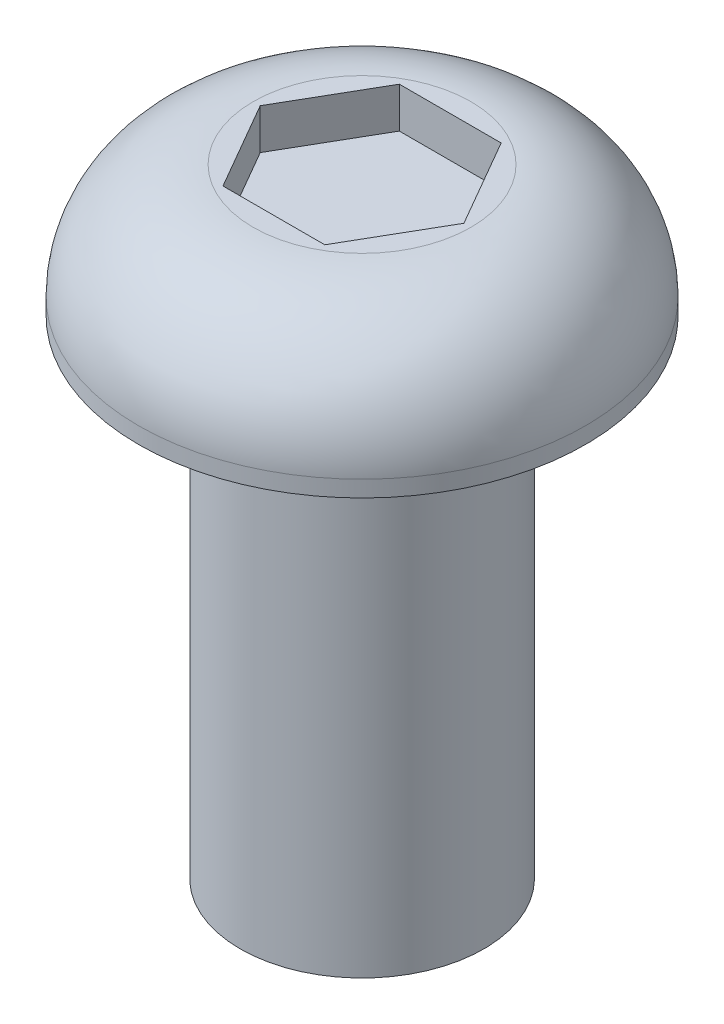
ISO-10303-21;
HEADER;
FILE_DESCRIPTION(('STEP AP214'),'2;1');
FILE_NAME('part.step','',(''),(''),'','','');
FILE_SCHEMA(('AUTOMOTIVE_DESIGN { 1 0 10303 214 1 1 1 1 }'));
ENDSEC;
DATA;
#1=APPLICATION_CONTEXT('core data for automotive mechanical design processes');
#2=APPLICATION_PROTOCOL_DEFINITION('international standard','automotive_design',2000,#1);
#3=PRODUCT_CONTEXT('',#1,'mechanical');
#4=PRODUCT('Part','Part','',(#3));
#5=PRODUCT_RELATED_PRODUCT_CATEGORY('part','',(#4));
#6=PRODUCT_DEFINITION_FORMATION('','',#4);
#7=PRODUCT_DEFINITION_CONTEXT('part definition',#1,'design');
#8=PRODUCT_DEFINITION('design','',#6,#7);
#9=PRODUCT_DEFINITION_SHAPE('','',#8);
#10=(LENGTH_UNIT() NAMED_UNIT(*) SI_UNIT(.MILLI.,.METRE.));
#11=(NAMED_UNIT(*) PLANE_ANGLE_UNIT() SI_UNIT($,.RADIAN.));
#12=(NAMED_UNIT(*) SI_UNIT($,.STERADIAN.) SOLID_ANGLE_UNIT());
#13=UNCERTAINTY_MEASURE_WITH_UNIT(LENGTH_MEASURE(1.E-05),#10,'distance_accuracy_value','');
#14=(GEOMETRIC_REPRESENTATION_CONTEXT(3) GLOBAL_UNCERTAINTY_ASSIGNED_CONTEXT((#13)) GLOBAL_UNIT_ASSIGNED_CONTEXT((#10,
#11,#12)) REPRESENTATION_CONTEXT('',''));
#15=CARTESIAN_POINT('',(0.,0.,0.));
#16=DIRECTION('',(0.,0.,1.));
#17=DIRECTION('',(1.,0.,0.));
#18=AXIS2_PLACEMENT_3D('',#15,#16,#17);
#19=CARTESIAN_POINT('',(0.,1.61,0.));
#20=DIRECTION('',(0.,-1.,0.));
#21=DIRECTION('',(0.,0.,-1.));
#22=AXIS2_PLACEMENT_3D('',#19,#20,#21);
#23=PLANE('',#22);
#24=DIRECTION('',(-1.,0.,0.));
#25=VECTOR('',#24,1.);
#26=CARTESIAN_POINT('',(0.626542480252685,1.61,-1.08520340889787));
#27=LINE('',#26,#25);
#28=CARTESIAN_POINT('',(0.626542480252685,1.61,-1.08520340889787));
#29=VERTEX_POINT('',#28);
#30=CARTESIAN_POINT('',(-0.626542480252684,1.61,-1.08520340889787));
#31=VERTEX_POINT('',#30);
#32=EDGE_CURVE('E133',#29,#31,#27,.T.);
#33=ORIENTED_EDGE('',*,*,#32,.F.);
#34=DIRECTION('',(-0.5,0.,-0.866025403784439));
#35=VECTOR('',#34,1.);
#36=CARTESIAN_POINT('',(1.25308496050537,1.61,0.));
#37=LINE('',#36,#35);
#38=CARTESIAN_POINT('',(1.25308496050537,1.61,0.));
#39=VERTEX_POINT('',#38);
#40=EDGE_CURVE('E51',#39,#29,#37,.T.);
#41=ORIENTED_EDGE('',*,*,#40,.F.);
#42=DIRECTION('',(0.5,0.,-0.866025403784439));
#43=VECTOR('',#42,1.);
#44=CARTESIAN_POINT('',(0.626542480252685,1.61,1.08520340889787));
#45=LINE('',#44,#43);
#46=CARTESIAN_POINT('',(0.626542480252685,1.61,1.08520340889787));
#47=VERTEX_POINT('',#46);
#48=EDGE_CURVE('E145',#47,#39,#45,.T.);
#49=ORIENTED_EDGE('',*,*,#48,.F.);
#50=DIRECTION('',(1.,0.,0.));
#51=VECTOR('',#50,1.);
#52=CARTESIAN_POINT('',(-0.626542480252684,1.61,1.08520340889787));
#53=LINE('',#52,#51);
#54=CARTESIAN_POINT('',(-0.626542480252684,1.61,1.08520340889787));
#55=VERTEX_POINT('',#54);
#56=EDGE_CURVE('E142',#55,#47,#53,.T.);
#57=ORIENTED_EDGE('',*,*,#56,.F.);
#58=DIRECTION('',(0.5,0.,0.866025403784439));
#59=VECTOR('',#58,1.);
#60=CARTESIAN_POINT('',(-1.25308496050537,1.61,0.));
#61=LINE('',#60,#59);
#62=CARTESIAN_POINT('',(-1.25308496050537,1.61,0.));
#63=VERTEX_POINT('',#62);
#64=EDGE_CURVE('E99',#63,#55,#61,.T.);
#65=ORIENTED_EDGE('',*,*,#64,.F.);
#66=DIRECTION('',(-0.5,0.,0.866025403784439));
#67=VECTOR('',#66,1.);
#68=CARTESIAN_POINT('',(-0.626542480252684,1.61,-1.08520340889787));
#69=LINE('',#68,#67);
#70=EDGE_CURVE('E136',#31,#63,#69,.T.);
#71=ORIENTED_EDGE('',*,*,#70,.F.);
#72=EDGE_LOOP('',(#33,#41,#49,#57,#65,#71));
#73=FACE_BOUND('',#72,.T.);
#74=CARTESIAN_POINT('',(0.,1.61,0.));
#75=DIRECTION('',(0.,1.,0.));
#76=DIRECTION('',(0.,0.,1.));
#77=AXIS2_PLACEMENT_3D('',#74,#75,#76);
#78=CIRCLE('',#77,1.34);
#79=CARTESIAN_POINT('',(0.,1.61,1.34));
#80=VERTEX_POINT('',#79);
#81=EDGE_CURVE('E11',#80,#80,#78,.T.);
#82=ORIENTED_EDGE('',*,*,#81,.T.);
#83=EDGE_LOOP('',(#82));
#84=FACE_BOUND('',#83,.T.);
#85=ADVANCED_FACE('F36',(#73,#84),#23,.F.);
#86=CARTESIAN_POINT('',(0.,0.2,0.));
#87=DIRECTION('',(0.,1.,0.));
#88=DIRECTION('',(0.,0.,1.));
#89=AXIS2_PLACEMENT_3D('',#86,#87,#88);
#90=DEGENERATE_TOROIDAL_SURFACE('',#89,1.34,1.41,.T.);
#91=ORIENTED_EDGE('',*,*,#81,.F.);
#92=EDGE_LOOP('',(#91));
#93=FACE_BOUND('',#92,.T.);
#94=CARTESIAN_POINT('',(0.,0.200000000000001,0.));
#95=DIRECTION('',(0.,1.,0.));
#96=DIRECTION('',(0.,0.,1.));
#97=AXIS2_PLACEMENT_3D('',#94,#95,#96);
#98=CIRCLE('',#97,2.75);
#99=CARTESIAN_POINT('',(0.,0.200000000000001,2.75));
#100=VERTEX_POINT('',#99);
#101=EDGE_CURVE('E44',#100,#100,#98,.T.);
#102=ORIENTED_EDGE('',*,*,#101,.T.);
#103=EDGE_LOOP('',(#102));
#104=FACE_BOUND('',#103,.T.);
#105=ADVANCED_FACE('F174',(#93,#104),#90,.T.);
#106=CARTESIAN_POINT('',(0.,9.0837699693481,0.));
#107=DIRECTION('',(0.,1.,0.));
#108=DIRECTION('',(0.,0.,1.));
#109=AXIS2_PLACEMENT_3D('',#106,#107,#108);
#110=CYLINDRICAL_SURFACE('',#109,2.75);
#111=ORIENTED_EDGE('',*,*,#101,.F.);
#112=EDGE_LOOP('',(#111));
#113=FACE_BOUND('',#112,.T.);
#114=CARTESIAN_POINT('',(0.,0.,0.));
#115=DIRECTION('',(0.,1.,0.));
#116=DIRECTION('',(0.,0.,1.));
#117=AXIS2_PLACEMENT_3D('',#114,#115,#116);
#118=CIRCLE('',#117,2.75);
#119=CARTESIAN_POINT('',(0.,0.,2.75));
#120=VERTEX_POINT('',#119);
#121=EDGE_CURVE('E167',#120,#120,#118,.T.);
#122=ORIENTED_EDGE('',*,*,#121,.T.);
#123=EDGE_LOOP('',(#122));
#124=FACE_BOUND('',#123,.T.);
#125=ADVANCED_FACE('F176',(#113,#124),#110,.T.);
#126=CARTESIAN_POINT('',(2.75,0.,0.));
#127=DIRECTION('',(0.,1.,0.));
#128=DIRECTION('',(0.,0.,1.));
#129=AXIS2_PLACEMENT_3D('',#126,#127,#128);
#130=PLANE('',#129);
#131=ORIENTED_EDGE('',*,*,#121,.F.);
#132=EDGE_LOOP('',(#131));
#133=FACE_BOUND('',#132,.T.);
#134=CARTESIAN_POINT('',(0.,0.,0.));
#135=DIRECTION('',(0.,1.,0.));
#136=DIRECTION('',(0.,0.,1.));
#137=AXIS2_PLACEMENT_3D('',#134,#135,#136);
#138=CIRCLE('',#137,1.5);
#139=CARTESIAN_POINT('',(0.,0.,1.5));
#140=VERTEX_POINT('',#139);
#141=EDGE_CURVE('E164',#140,#140,#138,.T.);
#142=ORIENTED_EDGE('',*,*,#141,.T.);
#143=EDGE_LOOP('',(#142));
#144=FACE_BOUND('',#143,.T.);
#145=ADVANCED_FACE('F179',(#133,#144),#130,.F.);
#146=CARTESIAN_POINT('',(0.,9.0837699693481,0.));
#147=DIRECTION('',(0.,1.,0.));
#148=DIRECTION('',(0.,0.,1.));
#149=AXIS2_PLACEMENT_3D('',#146,#147,#148);
#150=CYLINDRICAL_SURFACE('',#149,1.5);
#151=ORIENTED_EDGE('',*,*,#141,.F.);
#152=EDGE_LOOP('',(#151));
#153=FACE_BOUND('',#152,.T.);
#154=CARTESIAN_POINT('',(0.,-6.,0.));
#155=DIRECTION('',(0.,1.,0.));
#156=DIRECTION('',(0.,0.,1.));
#157=AXIS2_PLACEMENT_3D('',#154,#155,#156);
#158=CIRCLE('',#157,1.5);
#159=CARTESIAN_POINT('',(0.,-6.,1.5));
#160=VERTEX_POINT('',#159);
#161=EDGE_CURVE('E151',#160,#160,#158,.T.);
#162=ORIENTED_EDGE('',*,*,#161,.T.);
#163=EDGE_LOOP('',(#162));
#164=FACE_BOUND('',#163,.T.);
#165=ADVANCED_FACE('F185',(#153,#164),#150,.T.);
#166=CARTESIAN_POINT('',(1.5,-6.,0.));
#167=DIRECTION('',(0.,1.,0.));
#168=DIRECTION('',(0.,0.,1.));
#169=AXIS2_PLACEMENT_3D('',#166,#167,#168);
#170=PLANE('',#169);
#171=ORIENTED_EDGE('',*,*,#161,.F.);
#172=EDGE_LOOP('',(#171));
#173=FACE_BOUND('',#172,.T.);
#174=ADVANCED_FACE('F191',(#173),#170,.F.);
#175=CARTESIAN_POINT('',(1.25308496050537,1.11,0.));
#176=DIRECTION('',(0.866025403784439,0.,-0.5));
#177=DIRECTION('',(-0.5,0.,-0.866025403784439));
#178=AXIS2_PLACEMENT_3D('',#175,#176,#177);
#179=PLANE('',#178);
#180=ORIENTED_EDGE('',*,*,#40,.T.);
#181=DIRECTION('',(0.,1.,0.));
#182=VECTOR('',#181,1.);
#183=CARTESIAN_POINT('',(0.626542480252685,1.11,-1.08520340889787));
#184=LINE('',#183,#182);
#185=CARTESIAN_POINT('',(0.626542480252685,1.11,-1.08520340889787));
#186=VERTEX_POINT('',#185);
#187=EDGE_CURVE('E81',#186,#29,#184,.T.);
#188=ORIENTED_EDGE('',*,*,#187,.F.);
#189=DIRECTION('',(-0.5,0.,-0.866025403784439));
#190=VECTOR('',#189,1.);
#191=CARTESIAN_POINT('',(1.25308496050537,1.11,0.));
#192=LINE('',#191,#190);
#193=CARTESIAN_POINT('',(1.25308496050537,1.11,0.));
#194=VERTEX_POINT('',#193);
#195=EDGE_CURVE('E148',#194,#186,#192,.T.);
#196=ORIENTED_EDGE('',*,*,#195,.F.);
#197=DIRECTION('',(0.,1.,0.));
#198=VECTOR('',#197,1.);
#199=CARTESIAN_POINT('',(1.25308496050537,1.11,0.));
#200=LINE('',#199,#198);
#201=EDGE_CURVE('E59',#194,#39,#200,.T.);
#202=ORIENTED_EDGE('',*,*,#201,.T.);
#203=EDGE_LOOP('',(#180,#188,#196,#202));
#204=FACE_BOUND('',#203,.T.);
#205=ADVANCED_FACE('F196',(#204),#179,.F.);
#206=CARTESIAN_POINT('',(0.626542480252685,1.11,1.08520340889787));
#207=DIRECTION('',(0.866025403784439,0.,0.5));
#208=DIRECTION('',(0.5,0.,-0.866025403784439));
#209=AXIS2_PLACEMENT_3D('',#206,#207,#208);
#210=PLANE('',#209);
#211=ORIENTED_EDGE('',*,*,#48,.T.);
#212=ORIENTED_EDGE('',*,*,#201,.F.);
#213=DIRECTION('',(0.5,0.,-0.866025403784439));
#214=VECTOR('',#213,1.);
#215=CARTESIAN_POINT('',(0.626542480252685,1.11,1.08520340889787));
#216=LINE('',#215,#214);
#217=CARTESIAN_POINT('',(0.626542480252685,1.11,1.08520340889787));
#218=VERTEX_POINT('',#217);
#219=EDGE_CURVE('E113',#218,#194,#216,.T.);
#220=ORIENTED_EDGE('',*,*,#219,.F.);
#221=DIRECTION('',(0.,1.,0.));
#222=VECTOR('',#221,1.);
#223=CARTESIAN_POINT('',(0.626542480252685,1.11,1.08520340889787));
#224=LINE('',#223,#222);
#225=EDGE_CURVE('E104',#218,#47,#224,.T.);
#226=ORIENTED_EDGE('',*,*,#225,.T.);
#227=EDGE_LOOP('',(#211,#212,#220,#226));
#228=FACE_BOUND('',#227,.T.);
#229=ADVANCED_FACE('F201',(#228),#210,.F.);
#230=CARTESIAN_POINT('',(-0.626542480252684,1.11,1.08520340889787));
#231=DIRECTION('',(0.,0.,1.));
#232=DIRECTION('',(1.,0.,0.));
#233=AXIS2_PLACEMENT_3D('',#230,#231,#232);
#234=PLANE('',#233);
#235=ORIENTED_EDGE('',*,*,#56,.T.);
#236=ORIENTED_EDGE('',*,*,#225,.F.);
#237=DIRECTION('',(1.,0.,0.));
#238=VECTOR('',#237,1.);
#239=CARTESIAN_POINT('',(-0.626542480252684,1.11,1.08520340889787));
#240=LINE('',#239,#238);
#241=CARTESIAN_POINT('',(-0.626542480252684,1.11,1.08520340889787));
#242=VERTEX_POINT('',#241);
#243=EDGE_CURVE('E108',#242,#218,#240,.T.);
#244=ORIENTED_EDGE('',*,*,#243,.F.);
#245=DIRECTION('',(0.,1.,0.));
#246=VECTOR('',#245,1.);
#247=CARTESIAN_POINT('',(-0.626542480252684,1.11,1.08520340889787));
#248=LINE('',#247,#246);
#249=EDGE_CURVE('E92',#242,#55,#248,.T.);
#250=ORIENTED_EDGE('',*,*,#249,.T.);
#251=EDGE_LOOP('',(#235,#236,#244,#250));
#252=FACE_BOUND('',#251,.T.);
#253=ADVANCED_FACE('F109',(#252),#234,.F.);
#254=CARTESIAN_POINT('',(-1.25308496050537,1.11,0.));
#255=DIRECTION('',(-0.866025403784439,0.,0.5));
#256=DIRECTION('',(0.5,0.,0.866025403784439));
#257=AXIS2_PLACEMENT_3D('',#254,#255,#256);
#258=PLANE('',#257);
#259=ORIENTED_EDGE('',*,*,#64,.T.);
#260=ORIENTED_EDGE('',*,*,#249,.F.);
#261=DIRECTION('',(0.5,0.,0.866025403784439));
#262=VECTOR('',#261,1.);
#263=CARTESIAN_POINT('',(-1.25308496050537,1.11,0.));
#264=LINE('',#263,#262);
#265=CARTESIAN_POINT('',(-1.25308496050537,1.11,0.));
#266=VERTEX_POINT('',#265);
#267=EDGE_CURVE('E96',#266,#242,#264,.T.);
#268=ORIENTED_EDGE('',*,*,#267,.F.);
#269=DIRECTION('',(0.,1.,0.));
#270=VECTOR('',#269,1.);
#271=CARTESIAN_POINT('',(-1.25308496050537,1.11,0.));
#272=LINE('',#271,#270);
#273=EDGE_CURVE('E105',#266,#63,#272,.T.);
#274=ORIENTED_EDGE('',*,*,#273,.T.);
#275=EDGE_LOOP('',(#259,#260,#268,#274));
#276=FACE_BOUND('',#275,.T.);
#277=ADVANCED_FACE('F94',(#276),#258,.F.);
#278=CARTESIAN_POINT('',(-0.626542480252684,1.11,-1.08520340889787));
#279=DIRECTION('',(-0.866025403784439,0.,-0.5));
#280=DIRECTION('',(-0.5,0.,0.866025403784439));
#281=AXIS2_PLACEMENT_3D('',#278,#279,#280);
#282=PLANE('',#281);
#283=ORIENTED_EDGE('',*,*,#70,.T.);
#284=ORIENTED_EDGE('',*,*,#273,.F.);
#285=DIRECTION('',(-0.5,0.,0.866025403784439));
#286=VECTOR('',#285,1.);
#287=CARTESIAN_POINT('',(-0.626542480252684,1.11,-1.08520340889787));
#288=LINE('',#287,#286);
#289=CARTESIAN_POINT('',(-0.626542480252684,1.11,-1.08520340889787));
#290=VERTEX_POINT('',#289);
#291=EDGE_CURVE('E119',#290,#266,#288,.T.);
#292=ORIENTED_EDGE('',*,*,#291,.F.);
#293=DIRECTION('',(0.,1.,0.));
#294=VECTOR('',#293,1.);
#295=CARTESIAN_POINT('',(-0.626542480252684,1.11,-1.08520340889787));
#296=LINE('',#295,#294);
#297=EDGE_CURVE('E156',#290,#31,#296,.T.);
#298=ORIENTED_EDGE('',*,*,#297,.T.);
#299=EDGE_LOOP('',(#283,#284,#292,#298));
#300=FACE_BOUND('',#299,.T.);
#301=ADVANCED_FACE('F229',(#300),#282,.F.);
#302=CARTESIAN_POINT('',(0.626542480252685,1.11,-1.08520340889787));
#303=DIRECTION('',(0.,0.,-1.));
#304=DIRECTION('',(-1.,0.,0.));
#305=AXIS2_PLACEMENT_3D('',#302,#303,#304);
#306=PLANE('',#305);
#307=ORIENTED_EDGE('',*,*,#32,.T.);
#308=ORIENTED_EDGE('',*,*,#297,.F.);
#309=DIRECTION('',(-1.,0.,0.));
#310=VECTOR('',#309,1.);
#311=CARTESIAN_POINT('',(0.626542480252685,1.11,-1.08520340889787));
#312=LINE('',#311,#310);
#313=EDGE_CURVE('E125',#186,#290,#312,.T.);
#314=ORIENTED_EDGE('',*,*,#313,.F.);
#315=ORIENTED_EDGE('',*,*,#187,.T.);
#316=EDGE_LOOP('',(#307,#308,#314,#315));
#317=FACE_BOUND('',#316,.T.);
#318=ADVANCED_FACE('F215',(#317),#306,.F.);
#319=CARTESIAN_POINT('',(0.,1.11,0.));
#320=DIRECTION('',(0.,1.,0.));
#321=DIRECTION('',(0.,0.,1.));
#322=AXIS2_PLACEMENT_3D('',#319,#320,#321);
#323=PLANE('',#322);
#324=ORIENTED_EDGE('',*,*,#195,.T.);
#325=ORIENTED_EDGE('',*,*,#313,.T.);
#326=ORIENTED_EDGE('',*,*,#291,.T.);
#327=ORIENTED_EDGE('',*,*,#267,.T.);
#328=ORIENTED_EDGE('',*,*,#243,.T.);
#329=ORIENTED_EDGE('',*,*,#219,.T.);
#330=EDGE_LOOP('',(#324,#325,#326,#327,#328,#329));
#331=FACE_BOUND('',#330,.T.);
#332=ADVANCED_FACE('F116',(#331),#323,.T.);
#333=CLOSED_SHELL('',(#85,#105,#125,#145,#165,#174,#205,#229,#253,#277,#301,#318,#332));
#334=MANIFOLD_SOLID_BREP('B2',#333);
#335=ADVANCED_BREP_SHAPE_REPRESENTATION('',(#18,#334),#14);
#336=SHAPE_DEFINITION_REPRESENTATION(#9,#335);
ENDSEC;
END-ISO-10303-21;
